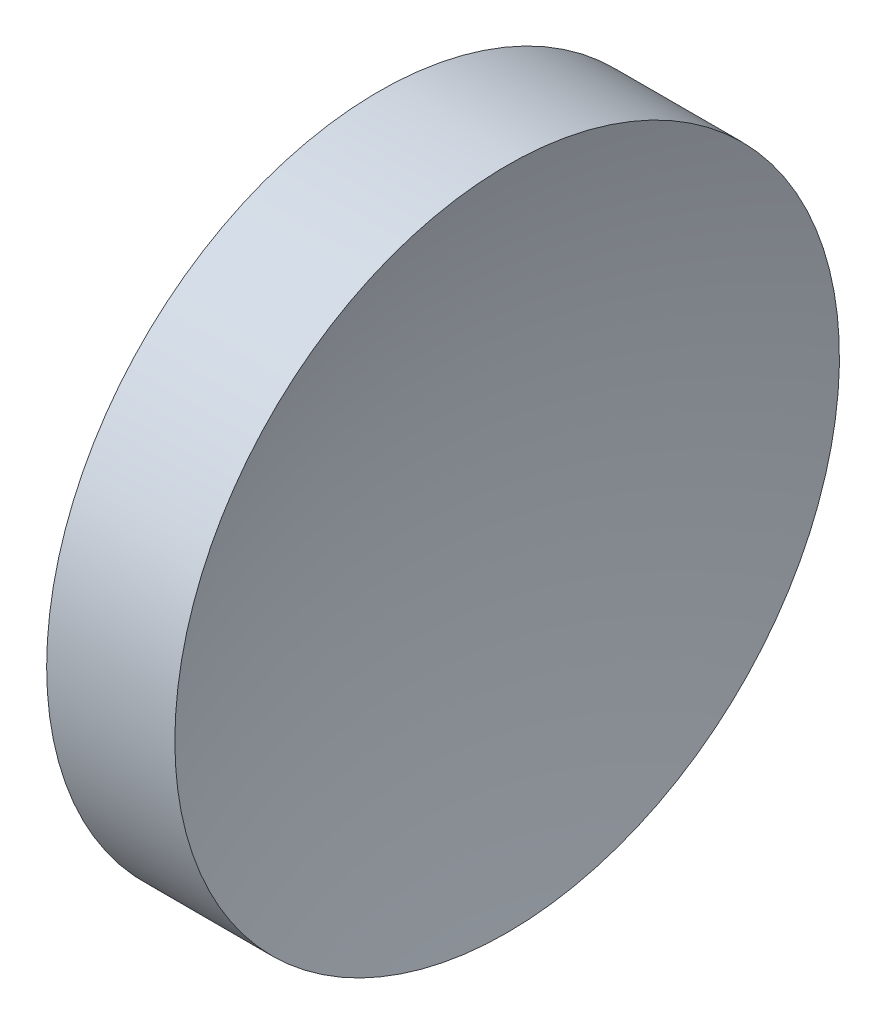
ISO-10303-21;
HEADER;
FILE_DESCRIPTION(('STEP AP214'),'2;1');
FILE_NAME('part.step','',(''),(''),'','','');
FILE_SCHEMA(('AUTOMOTIVE_DESIGN { 1 0 10303 214 1 1 1 1 }'));
ENDSEC;
DATA;
#1=APPLICATION_CONTEXT('core data for automotive mechanical design processes');
#2=APPLICATION_PROTOCOL_DEFINITION('international standard','automotive_design',2000,#1);
#3=PRODUCT_CONTEXT('',#1,'mechanical');
#4=PRODUCT('Part','Part','',(#3));
#5=PRODUCT_RELATED_PRODUCT_CATEGORY('part','',(#4));
#6=PRODUCT_DEFINITION_FORMATION('','',#4);
#7=PRODUCT_DEFINITION_CONTEXT('part definition',#1,'design');
#8=PRODUCT_DEFINITION('design','',#6,#7);
#9=PRODUCT_DEFINITION_SHAPE('','',#8);
#10=(LENGTH_UNIT() NAMED_UNIT(*) SI_UNIT(.MILLI.,.METRE.));
#11=(NAMED_UNIT(*) PLANE_ANGLE_UNIT() SI_UNIT($,.RADIAN.));
#12=(NAMED_UNIT(*) SI_UNIT($,.STERADIAN.) SOLID_ANGLE_UNIT());
#13=UNCERTAINTY_MEASURE_WITH_UNIT(LENGTH_MEASURE(1.E-05),#10,'distance_accuracy_value','');
#14=(GEOMETRIC_REPRESENTATION_CONTEXT(3) GLOBAL_UNCERTAINTY_ASSIGNED_CONTEXT((#13)) GLOBAL_UNIT_ASSIGNED_CONTEXT((#10,
#11,#12)) REPRESENTATION_CONTEXT('',''));
#15=CARTESIAN_POINT('',(0.,0.,0.));
#16=DIRECTION('',(0.,0.,1.));
#17=DIRECTION('',(1.,0.,0.));
#18=AXIS2_PLACEMENT_3D('',#15,#16,#17);
#19=CARTESIAN_POINT('',(165.906834178548,71.1939890865937,0.));
#20=DIRECTION('',(-1.,0.,0.));
#21=DIRECTION('',(0.,-1.,0.));
#22=AXIS2_PLACEMENT_3D('',#19,#20,#21);
#23=SPHERICAL_SURFACE('',#22,43.4);
#24=CARTESIAN_POINT('',(124.406593215392,71.1939890865937,0.));
#25=DIRECTION('',(-1.,0.,0.));
#26=DIRECTION('',(0.,0.,1.));
#27=AXIS2_PLACEMENT_3D('',#24,#25,#26);
#28=CIRCLE('',#27,12.7);
#29=CARTESIAN_POINT('',(124.406593215392,71.1939890865937,12.7));
#30=VERTEX_POINT('',#29);
#31=EDGE_CURVE('E10',#30,#30,#28,.T.);
#32=ORIENTED_EDGE('',*,*,#31,.F.);
#33=EDGE_LOOP('',(#32));
#34=FACE_BOUND('',#33,.T.);
#35=ADVANCED_FACE('F35',(#34),#23,.F.);
#36=CARTESIAN_POINT('',(111.955229757561,71.1939890865937,0.));
#37=DIRECTION('',(-1.,0.,0.));
#38=DIRECTION('',(0.,0.,1.));
#39=AXIS2_PLACEMENT_3D('',#36,#37,#38);
#40=CYLINDRICAL_SURFACE('',#39,12.7);
#41=CARTESIAN_POINT('',(119.506834178548,71.1939890865937,0.));
#42=DIRECTION('',(-1.,0.,0.));
#43=DIRECTION('',(0.,0.,1.));
#44=AXIS2_PLACEMENT_3D('',#41,#42,#43);
#45=CIRCLE('',#44,12.7);
#46=CARTESIAN_POINT('',(119.506834178548,71.1939890865937,12.7));
#47=VERTEX_POINT('',#46);
#48=EDGE_CURVE('E41',#47,#47,#45,.T.);
#49=ORIENTED_EDGE('',*,*,#48,.F.);
#50=EDGE_LOOP('',(#49));
#51=FACE_BOUND('',#50,.T.);
#52=ORIENTED_EDGE('',*,*,#31,.T.);
#53=EDGE_LOOP('',(#52));
#54=FACE_BOUND('',#53,.T.);
#55=ADVANCED_FACE('F49',(#51,#54),#40,.T.);
#56=CARTESIAN_POINT('',(119.506834178548,71.1939890865937,0.));
#57=DIRECTION('',(1.,0.,0.));
#58=DIRECTION('',(0.,0.,-1.));
#59=AXIS2_PLACEMENT_3D('',#56,#57,#58);
#60=PLANE('',#59);
#61=ORIENTED_EDGE('',*,*,#48,.T.);
#62=EDGE_LOOP('',(#61));
#63=FACE_BOUND('',#62,.T.);
#64=ADVANCED_FACE('F47',(#63),#60,.F.);
#65=CLOSED_SHELL('',(#35,#55,#64));
#66=MANIFOLD_SOLID_BREP('B2',#65);
#67=ADVANCED_BREP_SHAPE_REPRESENTATION('',(#18,#66),#14);
#68=SHAPE_DEFINITION_REPRESENTATION(#9,#67);
ENDSEC;
END-ISO-10303-21;
